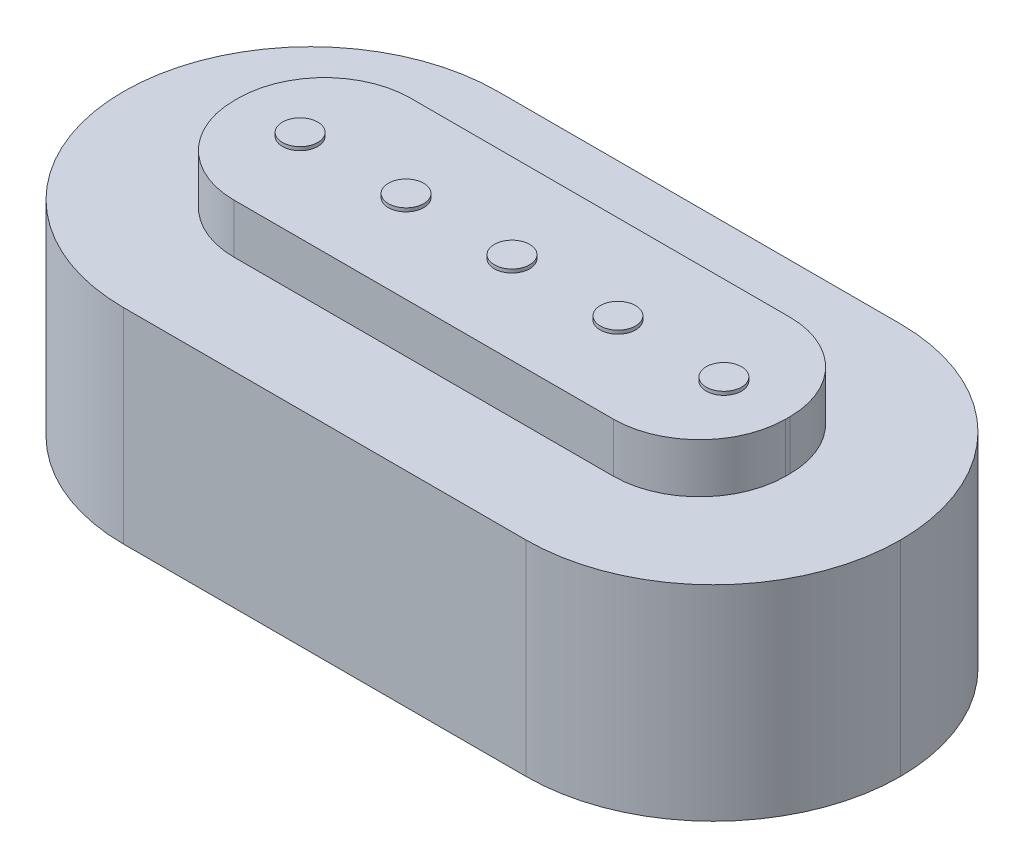
ISO-10303-21;
HEADER;
FILE_DESCRIPTION(('STEP AP214'),'2;1');
FILE_NAME('part.step','',(''),(''),'','','');
FILE_SCHEMA(('AUTOMOTIVE_DESIGN { 1 0 10303 214 1 1 1 1 }'));
ENDSEC;
DATA;
#1=APPLICATION_CONTEXT('core data for automotive mechanical design processes');
#2=APPLICATION_PROTOCOL_DEFINITION('international standard','automotive_design',2000,#1);
#3=PRODUCT_CONTEXT('',#1,'mechanical');
#4=PRODUCT('Part','Part','',(#3));
#5=PRODUCT_RELATED_PRODUCT_CATEGORY('part','',(#4));
#6=PRODUCT_DEFINITION_FORMATION('','',#4);
#7=PRODUCT_DEFINITION_CONTEXT('part definition',#1,'design');
#8=PRODUCT_DEFINITION('design','',#6,#7);
#9=PRODUCT_DEFINITION_SHAPE('','',#8);
#10=(LENGTH_UNIT() NAMED_UNIT(*) SI_UNIT(.MILLI.,.METRE.));
#11=(NAMED_UNIT(*) PLANE_ANGLE_UNIT() SI_UNIT($,.RADIAN.));
#12=(NAMED_UNIT(*) SI_UNIT($,.STERADIAN.) SOLID_ANGLE_UNIT());
#13=UNCERTAINTY_MEASURE_WITH_UNIT(LENGTH_MEASURE(1.E-05),#10,'distance_accuracy_value','');
#14=(GEOMETRIC_REPRESENTATION_CONTEXT(3) GLOBAL_UNCERTAINTY_ASSIGNED_CONTEXT((#13)) GLOBAL_UNIT_ASSIGNED_CONTEXT((#10,
#11,#12)) REPRESENTATION_CONTEXT('',''));
#15=CARTESIAN_POINT('',(0.,0.,0.));
#16=DIRECTION('',(0.,0.,1.));
#17=DIRECTION('',(1.,0.,0.));
#18=AXIS2_PLACEMENT_3D('',#15,#16,#17);
#19=CARTESIAN_POINT('',(-3.90322580645161,2.9,3.78036465638149));
#20=DIRECTION('',(0.,0.,-1.));
#21=DIRECTION('',(-1.,0.,0.));
#22=AXIS2_PLACEMENT_3D('',#19,#20,#21);
#23=PLANE('',#22);
#24=DIRECTION('',(1.,0.,0.));
#25=VECTOR('',#24,1.);
#26=CARTESIAN_POINT('',(-3.90322580645161,2.9,3.78036465638149));
#27=LINE('',#26,#25);
#28=CARTESIAN_POINT('',(-1.25322580645161,2.9,3.78036465638149));
#29=VERTEX_POINT('',#28);
#30=CARTESIAN_POINT('',(4.44677419354839,2.9,3.78036465638149));
#31=VERTEX_POINT('',#30);
#32=EDGE_CURVE('E301',#29,#31,#27,.T.);
#33=ORIENTED_EDGE('',*,*,#32,.F.);
#34=DIRECTION('',(0.,-1.,0.));
#35=VECTOR('',#34,1.);
#36=CARTESIAN_POINT('',(-1.25322580645161,2.9,3.78036465638149));
#37=LINE('',#36,#35);
#38=CARTESIAN_POINT('',(-1.25322580645161,0.,3.78036465638149));
#39=VERTEX_POINT('',#38);
#40=EDGE_CURVE('E196',#29,#39,#37,.T.);
#41=ORIENTED_EDGE('',*,*,#40,.T.);
#42=DIRECTION('',(1.,0.,0.));
#43=VECTOR('',#42,1.);
#44=CARTESIAN_POINT('',(-3.90322580645161,0.,3.78036465638149));
#45=LINE('',#44,#43);
#46=CARTESIAN_POINT('',(4.44677419354839,0.,3.78036465638149));
#47=VERTEX_POINT('',#46);
#48=EDGE_CURVE('E152',#39,#47,#45,.T.);
#49=ORIENTED_EDGE('',*,*,#48,.T.);
#50=DIRECTION('',(0.,-1.,0.));
#51=VECTOR('',#50,1.);
#52=CARTESIAN_POINT('',(4.44677419354839,2.9,3.78036465638149));
#53=LINE('',#52,#51);
#54=EDGE_CURVE('E192',#47,#31,#53,.F.);
#55=ORIENTED_EDGE('',*,*,#54,.T.);
#56=EDGE_LOOP('',(#33,#41,#49,#55));
#57=FACE_BOUND('',#56,.T.);
#58=ADVANCED_FACE('F43',(#57),#23,.F.);
#59=CARTESIAN_POINT('',(-3.90322580645161,2.9,-1.51963534361851));
#60=DIRECTION('',(0.,0.,1.));
#61=DIRECTION('',(1.,0.,0.));
#62=AXIS2_PLACEMENT_3D('',#59,#60,#61);
#63=PLANE('',#62);
#64=DIRECTION('',(-1.,0.,0.));
#65=VECTOR('',#64,1.);
#66=CARTESIAN_POINT('',(-3.90322580645161,0.,-1.51963534361851));
#67=LINE('',#66,#65);
#68=CARTESIAN_POINT('',(4.44677419354839,0.,-1.51963534361851));
#69=VERTEX_POINT('',#68);
#70=CARTESIAN_POINT('',(-1.25322580645161,0.,-1.51963534361851));
#71=VERTEX_POINT('',#70);
#72=EDGE_CURVE('E306',#69,#71,#67,.T.);
#73=ORIENTED_EDGE('',*,*,#72,.T.);
#74=DIRECTION('',(0.,-1.,0.));
#75=VECTOR('',#74,1.);
#76=CARTESIAN_POINT('',(-1.25322580645161,2.9,-1.51963534361851));
#77=LINE('',#76,#75);
#78=CARTESIAN_POINT('',(-1.25322580645161,2.9,-1.51963534361851));
#79=VERTEX_POINT('',#78);
#80=EDGE_CURVE('E171',#71,#79,#77,.F.);
#81=ORIENTED_EDGE('',*,*,#80,.T.);
#82=DIRECTION('',(-1.,0.,0.));
#83=VECTOR('',#82,1.);
#84=CARTESIAN_POINT('',(-3.90322580645161,2.9,-1.51963534361851));
#85=LINE('',#84,#83);
#86=CARTESIAN_POINT('',(4.44677419354839,2.9,-1.51963534361851));
#87=VERTEX_POINT('',#86);
#88=EDGE_CURVE('E305',#87,#79,#85,.T.);
#89=ORIENTED_EDGE('',*,*,#88,.F.);
#90=DIRECTION('',(0.,-1.,0.));
#91=VECTOR('',#90,1.);
#92=CARTESIAN_POINT('',(4.44677419354839,2.9,-1.51963534361851));
#93=LINE('',#92,#91);
#94=EDGE_CURVE('E173',#87,#69,#93,.T.);
#95=ORIENTED_EDGE('',*,*,#94,.T.);
#96=EDGE_LOOP('',(#73,#81,#89,#95));
#97=FACE_BOUND('',#96,.T.);
#98=ADVANCED_FACE('F391',(#97),#63,.F.);
#99=CARTESIAN_POINT('',(0.,2.9,0.));
#100=DIRECTION('',(0.,1.,0.));
#101=DIRECTION('',(0.,0.,1.));
#102=AXIS2_PLACEMENT_3D('',#99,#100,#101);
#103=PLANE('',#102);
#104=DIRECTION('',(0.,0.,1.));
#105=VECTOR('',#104,1.);
#106=CARTESIAN_POINT('',(-2.30822580645161,2.9,-0.119635343618514));
#107=LINE('',#106,#105);
#108=CARTESIAN_POINT('',(-2.30822580645161,2.9,1.10036465638149));
#109=VERTEX_POINT('',#108);
#110=CARTESIAN_POINT('',(-2.30822580645161,2.9,1.16036465638149));
#111=VERTEX_POINT('',#110);
#112=EDGE_CURVE('E253',#109,#111,#107,.T.);
#113=ORIENTED_EDGE('',*,*,#112,.F.);
#114=CARTESIAN_POINT('',(-1.08822580645161,2.9,1.10036465638149));
#115=DIRECTION('',(0.,1.,0.));
#116=DIRECTION('',(0.,0.,1.));
#117=AXIS2_PLACEMENT_3D('',#114,#115,#116);
#118=CIRCLE('',#117,1.22);
#119=CARTESIAN_POINT('',(-1.08822580645161,2.9,-0.119635343618514));
#120=VERTEX_POINT('',#119);
#121=EDGE_CURVE('E244',#109,#120,#118,.F.);
#122=ORIENTED_EDGE('',*,*,#121,.T.);
#123=DIRECTION('',(-1.,0.,0.));
#124=VECTOR('',#123,1.);
#125=CARTESIAN_POINT('',(-2.30822580645161,2.9,-0.119635343618514));
#126=LINE('',#125,#124);
#127=CARTESIAN_POINT('',(4.28177419354839,2.9,-0.119635343618513));
#128=VERTEX_POINT('',#127);
#129=EDGE_CURVE('E251',#128,#120,#126,.T.);
#130=ORIENTED_EDGE('',*,*,#129,.F.);
#131=CARTESIAN_POINT('',(4.28177419354839,2.9,1.10036465638149));
#132=DIRECTION('',(0.,1.,0.));
#133=DIRECTION('',(0.,0.,1.));
#134=AXIS2_PLACEMENT_3D('',#131,#132,#133);
#135=CIRCLE('',#134,1.22);
#136=CARTESIAN_POINT('',(5.50177419354839,2.9,1.10036465638149));
#137=VERTEX_POINT('',#136);
#138=EDGE_CURVE('E52',#128,#137,#135,.F.);
#139=ORIENTED_EDGE('',*,*,#138,.T.);
#140=DIRECTION('',(0.,0.,-1.));
#141=VECTOR('',#140,1.);
#142=CARTESIAN_POINT('',(5.50177419354839,2.9,-0.119635343618513));
#143=LINE('',#142,#141);
#144=CARTESIAN_POINT('',(5.50177419354839,2.9,1.16036465638149));
#145=VERTEX_POINT('',#144);
#146=EDGE_CURVE('E264',#145,#137,#143,.T.);
#147=ORIENTED_EDGE('',*,*,#146,.F.);
#148=CARTESIAN_POINT('',(4.28177419354839,2.9,1.16036465638149));
#149=DIRECTION('',(0.,1.,0.));
#150=DIRECTION('',(0.,0.,1.));
#151=AXIS2_PLACEMENT_3D('',#148,#149,#150);
#152=CIRCLE('',#151,1.22);
#153=CARTESIAN_POINT('',(4.28177419354839,2.9,2.38036465638149));
#154=VERTEX_POINT('',#153);
#155=EDGE_CURVE('E12',#145,#154,#152,.F.);
#156=ORIENTED_EDGE('',*,*,#155,.T.);
#157=DIRECTION('',(1.,0.,0.));
#158=VECTOR('',#157,1.);
#159=CARTESIAN_POINT('',(-2.30822580645161,2.9,2.38036465638149));
#160=LINE('',#159,#158);
#161=CARTESIAN_POINT('',(-1.08822580645161,2.9,2.38036465638149));
#162=VERTEX_POINT('',#161);
#163=EDGE_CURVE('E295',#162,#154,#160,.T.);
#164=ORIENTED_EDGE('',*,*,#163,.F.);
#165=CARTESIAN_POINT('',(-1.08822580645161,2.9,1.16036465638149));
#166=DIRECTION('',(0.,1.,0.));
#167=DIRECTION('',(0.,0.,1.));
#168=AXIS2_PLACEMENT_3D('',#165,#166,#167);
#169=CIRCLE('',#168,1.22);
#170=EDGE_CURVE('E241',#162,#111,#169,.F.);
#171=ORIENTED_EDGE('',*,*,#170,.T.);
#172=EDGE_LOOP('',(#113,#122,#130,#139,#147,#156,#164,#171));
#173=FACE_BOUND('',#172,.T.);
#174=ORIENTED_EDGE('',*,*,#88,.T.);
#175=CARTESIAN_POINT('',(-1.25322580645161,2.9,1.13036465638149));
#176=DIRECTION('',(0.,1.,0.));
#177=DIRECTION('',(0.,0.,1.));
#178=AXIS2_PLACEMENT_3D('',#175,#176,#177);
#179=CIRCLE('',#178,2.65);
#180=CARTESIAN_POINT('',(-3.90322580645161,2.9,1.13036465638149));
#181=VERTEX_POINT('',#180);
#182=EDGE_CURVE('E189',#79,#181,#179,.T.);
#183=ORIENTED_EDGE('',*,*,#182,.T.);
#184=CARTESIAN_POINT('',(-1.25322580645161,2.9,1.13036465638149));
#185=DIRECTION('',(0.,1.,0.));
#186=DIRECTION('',(0.,0.,1.));
#187=AXIS2_PLACEMENT_3D('',#184,#185,#186);
#188=CIRCLE('',#187,2.65);
#189=EDGE_CURVE('E162',#181,#29,#188,.T.);
#190=ORIENTED_EDGE('',*,*,#189,.T.);
#191=ORIENTED_EDGE('',*,*,#32,.T.);
#192=CARTESIAN_POINT('',(4.44677419354839,2.9,1.13036465638149));
#193=DIRECTION('',(0.,1.,0.));
#194=DIRECTION('',(0.,0.,1.));
#195=AXIS2_PLACEMENT_3D('',#192,#193,#194);
#196=CIRCLE('',#195,2.65);
#197=CARTESIAN_POINT('',(7.09677419354839,2.9,1.13036465638149));
#198=VERTEX_POINT('',#197);
#199=EDGE_CURVE('E184',#31,#198,#196,.T.);
#200=ORIENTED_EDGE('',*,*,#199,.T.);
#201=CARTESIAN_POINT('',(4.44677419354839,2.9,1.13036465638149));
#202=DIRECTION('',(0.,1.,0.));
#203=DIRECTION('',(0.,0.,1.));
#204=AXIS2_PLACEMENT_3D('',#201,#202,#203);
#205=CIRCLE('',#204,2.65);
#206=EDGE_CURVE('E181',#198,#87,#205,.T.);
#207=ORIENTED_EDGE('',*,*,#206,.T.);
#208=EDGE_LOOP('',(#174,#183,#190,#191,#200,#207));
#209=FACE_BOUND('',#208,.T.);
#210=ADVANCED_FACE('F249',(#173,#209),#103,.T.);
#211=CARTESIAN_POINT('',(0.,0.,0.));
#212=DIRECTION('',(0.,1.,0.));
#213=DIRECTION('',(0.,0.,1.));
#214=AXIS2_PLACEMENT_3D('',#211,#212,#213);
#215=PLANE('',#214);
#216=CARTESIAN_POINT('',(-1.40322580645161,0.,1.13036465638149));
#217=DIRECTION('',(0.,1.,0.));
#218=DIRECTION('',(0.,0.,1.));
#219=AXIS2_PLACEMENT_3D('',#216,#217,#218);
#220=CIRCLE('',#219,0.25);
#221=CARTESIAN_POINT('',(-1.40322580645161,0.,1.38036465638149));
#222=VERTEX_POINT('',#221);
#223=EDGE_CURVE('E542',#222,#222,#220,.T.);
#224=ORIENTED_EDGE('',*,*,#223,.T.);
#225=EDGE_LOOP('',(#224));
#226=FACE_BOUND('',#225,.T.);
#227=CARTESIAN_POINT('',(0.0967741935483884,0.,1.13036465638149));
#228=DIRECTION('',(0.,1.,0.));
#229=DIRECTION('',(0.,0.,1.));
#230=AXIS2_PLACEMENT_3D('',#227,#228,#229);
#231=CIRCLE('',#230,0.25);
#232=CARTESIAN_POINT('',(0.0967741935483884,0.,1.38036465638149));
#233=VERTEX_POINT('',#232);
#234=EDGE_CURVE('E550',#233,#233,#231,.T.);
#235=ORIENTED_EDGE('',*,*,#234,.T.);
#236=EDGE_LOOP('',(#235));
#237=FACE_BOUND('',#236,.T.);
#238=CARTESIAN_POINT('',(4.59677419354839,0.,1.13036465638149));
#239=DIRECTION('',(0.,1.,0.));
#240=DIRECTION('',(0.,0.,1.));
#241=AXIS2_PLACEMENT_3D('',#238,#239,#240);
#242=CIRCLE('',#241,0.25);
#243=CARTESIAN_POINT('',(4.59677419354839,0.,1.38036465638149));
#244=VERTEX_POINT('',#243);
#245=EDGE_CURVE('E562',#244,#244,#242,.T.);
#246=ORIENTED_EDGE('',*,*,#245,.T.);
#247=EDGE_LOOP('',(#246));
#248=FACE_BOUND('',#247,.T.);
#249=CARTESIAN_POINT('',(3.09677419354839,0.,1.13036465638149));
#250=DIRECTION('',(0.,1.,0.));
#251=DIRECTION('',(0.,0.,1.));
#252=AXIS2_PLACEMENT_3D('',#249,#250,#251);
#253=CIRCLE('',#252,0.25);
#254=CARTESIAN_POINT('',(3.09677419354839,0.,1.38036465638149));
#255=VERTEX_POINT('',#254);
#256=EDGE_CURVE('E570',#255,#255,#253,.T.);
#257=ORIENTED_EDGE('',*,*,#256,.T.);
#258=EDGE_LOOP('',(#257));
#259=FACE_BOUND('',#258,.T.);
#260=CARTESIAN_POINT('',(1.59677419354839,0.,1.13036465638149));
#261=DIRECTION('',(0.,1.,0.));
#262=DIRECTION('',(0.,0.,1.));
#263=AXIS2_PLACEMENT_3D('',#260,#261,#262);
#264=CIRCLE('',#263,0.25);
#265=CARTESIAN_POINT('',(1.59677419354839,0.,1.38036465638149));
#266=VERTEX_POINT('',#265);
#267=EDGE_CURVE('E285',#266,#266,#264,.T.);
#268=ORIENTED_EDGE('',*,*,#267,.T.);
#269=EDGE_LOOP('',(#268));
#270=FACE_BOUND('',#269,.T.);
#271=CARTESIAN_POINT('',(-1.25322580645161,0.,1.13036465638149));
#272=DIRECTION('',(0.,1.,0.));
#273=DIRECTION('',(0.,0.,1.));
#274=AXIS2_PLACEMENT_3D('',#271,#272,#273);
#275=CIRCLE('',#274,2.65);
#276=CARTESIAN_POINT('',(-3.90322580645161,0.,1.13036465638149));
#277=VERTEX_POINT('',#276);
#278=EDGE_CURVE('E144',#39,#277,#275,.F.);
#279=ORIENTED_EDGE('',*,*,#278,.T.);
#280=CARTESIAN_POINT('',(-1.25322580645161,0.,1.13036465638149));
#281=DIRECTION('',(0.,1.,0.));
#282=DIRECTION('',(0.,0.,1.));
#283=AXIS2_PLACEMENT_3D('',#280,#281,#282);
#284=CIRCLE('',#283,2.65);
#285=EDGE_CURVE('E149',#277,#71,#284,.F.);
#286=ORIENTED_EDGE('',*,*,#285,.T.);
#287=ORIENTED_EDGE('',*,*,#72,.F.);
#288=CARTESIAN_POINT('',(4.44677419354839,0.,1.13036465638149));
#289=DIRECTION('',(0.,1.,0.));
#290=DIRECTION('',(0.,0.,1.));
#291=AXIS2_PLACEMENT_3D('',#288,#289,#290);
#292=CIRCLE('',#291,2.65);
#293=CARTESIAN_POINT('',(7.09677419354839,0.,1.13036465638149));
#294=VERTEX_POINT('',#293);
#295=EDGE_CURVE('E374',#69,#294,#292,.F.);
#296=ORIENTED_EDGE('',*,*,#295,.T.);
#297=CARTESIAN_POINT('',(4.44677419354839,0.,1.13036465638149));
#298=DIRECTION('',(0.,1.,0.));
#299=DIRECTION('',(0.,0.,1.));
#300=AXIS2_PLACEMENT_3D('',#297,#298,#299);
#301=CIRCLE('',#300,2.65);
#302=EDGE_CURVE('E156',#294,#47,#301,.F.);
#303=ORIENTED_EDGE('',*,*,#302,.T.);
#304=ORIENTED_EDGE('',*,*,#48,.F.);
#305=EDGE_LOOP('',(#279,#286,#287,#296,#303,#304));
#306=FACE_BOUND('',#305,.T.);
#307=ADVANCED_FACE('F146',(#226,#237,#248,#259,#270,#306),#215,.F.);
#308=CARTESIAN_POINT('',(-2.30822580645161,3.6,-0.119635343618514));
#309=DIRECTION('',(1.,0.,0.));
#310=DIRECTION('',(0.,0.,-1.));
#311=AXIS2_PLACEMENT_3D('',#308,#309,#310);
#312=PLANE('',#311);
#313=ORIENTED_EDGE('',*,*,#112,.T.);
#314=DIRECTION('',(0.,-1.,0.));
#315=VECTOR('',#314,1.);
#316=CARTESIAN_POINT('',(-2.30822580645161,3.6,1.16036465638149));
#317=LINE('',#316,#315);
#318=CARTESIAN_POINT('',(-2.30822580645161,3.6,1.16036465638149));
#319=VERTEX_POINT('',#318);
#320=EDGE_CURVE('E213',#111,#319,#317,.F.);
#321=ORIENTED_EDGE('',*,*,#320,.T.);
#322=DIRECTION('',(0.,0.,1.));
#323=VECTOR('',#322,1.);
#324=CARTESIAN_POINT('',(-2.30822580645161,3.6,-0.119635343618514));
#325=LINE('',#324,#323);
#326=CARTESIAN_POINT('',(-2.30822580645161,3.6,1.10036465638149));
#327=VERTEX_POINT('',#326);
#328=EDGE_CURVE('E263',#327,#319,#325,.T.);
#329=ORIENTED_EDGE('',*,*,#328,.F.);
#330=DIRECTION('',(0.,-1.,0.));
#331=VECTOR('',#330,1.);
#332=CARTESIAN_POINT('',(-2.30822580645161,3.6,1.10036465638149));
#333=LINE('',#332,#331);
#334=EDGE_CURVE('E209',#327,#109,#333,.T.);
#335=ORIENTED_EDGE('',*,*,#334,.T.);
#336=EDGE_LOOP('',(#313,#321,#329,#335));
#337=FACE_BOUND('',#336,.T.);
#338=ADVANCED_FACE('F275',(#337),#312,.F.);
#339=CARTESIAN_POINT('',(-2.30822580645161,3.6,2.38036465638149));
#340=DIRECTION('',(0.,0.,-1.));
#341=DIRECTION('',(-1.,0.,0.));
#342=AXIS2_PLACEMENT_3D('',#339,#340,#341);
#343=PLANE('',#342);
#344=DIRECTION('',(1.,0.,0.));
#345=VECTOR('',#344,1.);
#346=CARTESIAN_POINT('',(-2.30822580645161,3.6,2.38036465638149));
#347=LINE('',#346,#345);
#348=CARTESIAN_POINT('',(-1.08822580645161,3.6,2.38036465638149));
#349=VERTEX_POINT('',#348);
#350=CARTESIAN_POINT('',(4.28177419354839,3.6,2.38036465638149));
#351=VERTEX_POINT('',#350);
#352=EDGE_CURVE('E278',#349,#351,#347,.T.);
#353=ORIENTED_EDGE('',*,*,#352,.F.);
#354=DIRECTION('',(0.,-1.,0.));
#355=VECTOR('',#354,1.);
#356=CARTESIAN_POINT('',(-1.08822580645161,3.6,2.38036465638149));
#357=LINE('',#356,#355);
#358=EDGE_CURVE('E205',#349,#162,#357,.T.);
#359=ORIENTED_EDGE('',*,*,#358,.T.);
#360=ORIENTED_EDGE('',*,*,#163,.T.);
#361=DIRECTION('',(0.,-1.,0.));
#362=VECTOR('',#361,1.);
#363=CARTESIAN_POINT('',(4.28177419354839,3.6,2.38036465638149));
#364=LINE('',#363,#362);
#365=EDGE_CURVE('E198',#154,#351,#364,.F.);
#366=ORIENTED_EDGE('',*,*,#365,.T.);
#367=EDGE_LOOP('',(#353,#359,#360,#366));
#368=FACE_BOUND('',#367,.T.);
#369=ADVANCED_FACE('F450',(#368),#343,.F.);
#370=CARTESIAN_POINT('',(5.50177419354839,3.6,-0.119635343618513));
#371=DIRECTION('',(-1.,0.,0.));
#372=DIRECTION('',(0.,0.,1.));
#373=AXIS2_PLACEMENT_3D('',#370,#371,#372);
#374=PLANE('',#373);
#375=ORIENTED_EDGE('',*,*,#146,.T.);
#376=DIRECTION('',(0.,-1.,0.));
#377=VECTOR('',#376,1.);
#378=CARTESIAN_POINT('',(5.50177419354839,3.6,1.10036465638149));
#379=LINE('',#378,#377);
#380=CARTESIAN_POINT('',(5.50177419354839,3.6,1.10036465638149));
#381=VERTEX_POINT('',#380);
#382=EDGE_CURVE('E238',#137,#381,#379,.F.);
#383=ORIENTED_EDGE('',*,*,#382,.T.);
#384=DIRECTION('',(0.,0.,-1.));
#385=VECTOR('',#384,1.);
#386=CARTESIAN_POINT('',(5.50177419354839,3.6,-0.119635343618513));
#387=LINE('',#386,#385);
#388=CARTESIAN_POINT('',(5.50177419354839,3.6,1.16036465638149));
#389=VERTEX_POINT('',#388);
#390=EDGE_CURVE('E282',#389,#381,#387,.T.);
#391=ORIENTED_EDGE('',*,*,#390,.F.);
#392=DIRECTION('',(0.,-1.,0.));
#393=VECTOR('',#392,1.);
#394=CARTESIAN_POINT('',(5.50177419354839,3.6,1.16036465638149));
#395=LINE('',#394,#393);
#396=EDGE_CURVE('E235',#389,#145,#395,.T.);
#397=ORIENTED_EDGE('',*,*,#396,.T.);
#398=EDGE_LOOP('',(#375,#383,#391,#397));
#399=FACE_BOUND('',#398,.T.);
#400=ADVANCED_FACE('F447',(#399),#374,.F.);
#401=CARTESIAN_POINT('',(-2.30822580645161,3.6,-0.119635343618514));
#402=DIRECTION('',(0.,0.,1.));
#403=DIRECTION('',(1.,0.,0.));
#404=AXIS2_PLACEMENT_3D('',#401,#402,#403);
#405=PLANE('',#404);
#406=ORIENTED_EDGE('',*,*,#129,.T.);
#407=DIRECTION('',(0.,-1.,0.));
#408=VECTOR('',#407,1.);
#409=CARTESIAN_POINT('',(-1.08822580645161,3.6,-0.119635343618514));
#410=LINE('',#409,#408);
#411=CARTESIAN_POINT('',(-1.08822580645161,3.6,-0.119635343618514));
#412=VERTEX_POINT('',#411);
#413=EDGE_CURVE('E232',#120,#412,#410,.F.);
#414=ORIENTED_EDGE('',*,*,#413,.T.);
#415=DIRECTION('',(-1.,0.,0.));
#416=VECTOR('',#415,1.);
#417=CARTESIAN_POINT('',(-2.30822580645161,3.6,-0.119635343618514));
#418=LINE('',#417,#416);
#419=CARTESIAN_POINT('',(4.28177419354839,3.6,-0.119635343618513));
#420=VERTEX_POINT('',#419);
#421=EDGE_CURVE('E273',#420,#412,#418,.T.);
#422=ORIENTED_EDGE('',*,*,#421,.F.);
#423=DIRECTION('',(0.,-1.,0.));
#424=VECTOR('',#423,1.);
#425=CARTESIAN_POINT('',(4.28177419354839,3.6,-0.119635343618513));
#426=LINE('',#425,#424);
#427=EDGE_CURVE('E228',#420,#128,#426,.T.);
#428=ORIENTED_EDGE('',*,*,#427,.T.);
#429=EDGE_LOOP('',(#406,#414,#422,#428));
#430=FACE_BOUND('',#429,.T.);
#431=ADVANCED_FACE('F258',(#430),#405,.F.);
#432=CARTESIAN_POINT('',(0.,3.6,0.));
#433=DIRECTION('',(0.,1.,0.));
#434=DIRECTION('',(0.,0.,1.));
#435=AXIS2_PLACEMENT_3D('',#432,#433,#434);
#436=PLANE('',#435);
#437=CARTESIAN_POINT('',(-1.40322580645161,3.6,1.13036465638149));
#438=DIRECTION('',(0.,1.,0.));
#439=DIRECTION('',(0.,0.,1.));
#440=AXIS2_PLACEMENT_3D('',#437,#438,#439);
#441=CIRCLE('',#440,0.25);
#442=CARTESIAN_POINT('',(-1.40322580645161,3.6,1.38036465638149));
#443=VERTEX_POINT('',#442);
#444=EDGE_CURVE('E330',#443,#443,#441,.T.);
#445=ORIENTED_EDGE('',*,*,#444,.F.);
#446=EDGE_LOOP('',(#445));
#447=FACE_BOUND('',#446,.T.);
#448=CARTESIAN_POINT('',(0.0967741935483884,3.6,1.13036465638149));
#449=DIRECTION('',(0.,1.,0.));
#450=DIRECTION('',(0.,0.,1.));
#451=AXIS2_PLACEMENT_3D('',#448,#449,#450);
#452=CIRCLE('',#451,0.25);
#453=CARTESIAN_POINT('',(0.0967741935483884,3.6,1.38036465638149));
#454=VERTEX_POINT('',#453);
#455=EDGE_CURVE('E326',#454,#454,#452,.T.);
#456=ORIENTED_EDGE('',*,*,#455,.F.);
#457=EDGE_LOOP('',(#456));
#458=FACE_BOUND('',#457,.T.);
#459=CARTESIAN_POINT('',(4.59677419354839,3.6,1.13036465638149));
#460=DIRECTION('',(0.,1.,0.));
#461=DIRECTION('',(0.,0.,1.));
#462=AXIS2_PLACEMENT_3D('',#459,#460,#461);
#463=CIRCLE('',#462,0.25);
#464=CARTESIAN_POINT('',(4.59677419354839,3.6,1.38036465638149));
#465=VERTEX_POINT('',#464);
#466=EDGE_CURVE('E322',#465,#465,#463,.T.);
#467=ORIENTED_EDGE('',*,*,#466,.F.);
#468=EDGE_LOOP('',(#467));
#469=FACE_BOUND('',#468,.T.);
#470=CARTESIAN_POINT('',(3.09677419354839,3.6,1.13036465638149));
#471=DIRECTION('',(0.,1.,0.));
#472=DIRECTION('',(0.,0.,1.));
#473=AXIS2_PLACEMENT_3D('',#470,#471,#472);
#474=CIRCLE('',#473,0.25);
#475=CARTESIAN_POINT('',(3.09677419354839,3.6,1.38036465638149));
#476=VERTEX_POINT('',#475);
#477=EDGE_CURVE('E318',#476,#476,#474,.T.);
#478=ORIENTED_EDGE('',*,*,#477,.F.);
#479=EDGE_LOOP('',(#478));
#480=FACE_BOUND('',#479,.T.);
#481=CARTESIAN_POINT('',(1.59677419354839,3.6,1.13036465638149));
#482=DIRECTION('',(0.,1.,0.));
#483=DIRECTION('',(0.,0.,1.));
#484=AXIS2_PLACEMENT_3D('',#481,#482,#483);
#485=CIRCLE('',#484,0.25);
#486=CARTESIAN_POINT('',(1.59677419354839,3.6,1.38036465638149));
#487=VERTEX_POINT('',#486);
#488=EDGE_CURVE('E310',#487,#487,#485,.T.);
#489=ORIENTED_EDGE('',*,*,#488,.F.);
#490=EDGE_LOOP('',(#489));
#491=FACE_BOUND('',#490,.T.);
#492=ORIENTED_EDGE('',*,*,#328,.T.);
#493=CARTESIAN_POINT('',(-1.08822580645161,3.6,1.16036465638149));
#494=DIRECTION('',(0.,1.,0.));
#495=DIRECTION('',(0.,0.,1.));
#496=AXIS2_PLACEMENT_3D('',#493,#494,#495);
#497=CIRCLE('',#496,1.22);
#498=EDGE_CURVE('E225',#319,#349,#497,.T.);
#499=ORIENTED_EDGE('',*,*,#498,.T.);
#500=ORIENTED_EDGE('',*,*,#352,.T.);
#501=CARTESIAN_POINT('',(4.28177419354839,3.6,1.16036465638149));
#502=DIRECTION('',(0.,1.,0.));
#503=DIRECTION('',(0.,0.,1.));
#504=AXIS2_PLACEMENT_3D('',#501,#502,#503);
#505=CIRCLE('',#504,1.22);
#506=EDGE_CURVE('E216',#351,#389,#505,.T.);
#507=ORIENTED_EDGE('',*,*,#506,.T.);
#508=ORIENTED_EDGE('',*,*,#390,.T.);
#509=CARTESIAN_POINT('',(4.28177419354839,3.6,1.10036465638149));
#510=DIRECTION('',(0.,1.,0.));
#511=DIRECTION('',(0.,0.,1.));
#512=AXIS2_PLACEMENT_3D('',#509,#510,#511);
#513=CIRCLE('',#512,1.22);
#514=EDGE_CURVE('E219',#381,#420,#513,.T.);
#515=ORIENTED_EDGE('',*,*,#514,.T.);
#516=ORIENTED_EDGE('',*,*,#421,.T.);
#517=CARTESIAN_POINT('',(-1.08822580645161,3.6,1.10036465638149));
#518=DIRECTION('',(0.,1.,0.));
#519=DIRECTION('',(0.,0.,1.));
#520=AXIS2_PLACEMENT_3D('',#517,#518,#519);
#521=CIRCLE('',#520,1.22);
#522=EDGE_CURVE('E222',#412,#327,#521,.T.);
#523=ORIENTED_EDGE('',*,*,#522,.T.);
#524=EDGE_LOOP('',(#492,#499,#500,#507,#508,#515,#516,#523));
#525=FACE_BOUND('',#524,.T.);
#526=ADVANCED_FACE('F271',(#447,#458,#469,#480,#491,#525),#436,.T.);
#527=CARTESIAN_POINT('',(0.,3.65,0.));
#528=DIRECTION('',(0.,1.,0.));
#529=DIRECTION('',(0.,0.,1.));
#530=AXIS2_PLACEMENT_3D('',#527,#528,#529);
#531=PLANE('',#530);
#532=CARTESIAN_POINT('',(1.59677419354839,3.65,1.13036465638149));
#533=DIRECTION('',(0.,1.,0.));
#534=DIRECTION('',(0.,0.,1.));
#535=AXIS2_PLACEMENT_3D('',#532,#533,#534);
#536=CIRCLE('',#535,0.25);
#537=CARTESIAN_POINT('',(1.59677419354839,3.65,1.38036465638149));
#538=VERTEX_POINT('',#537);
#539=EDGE_CURVE('E573',#538,#538,#536,.F.);
#540=ORIENTED_EDGE('',*,*,#539,.F.);
#541=EDGE_LOOP('',(#540));
#542=FACE_BOUND('',#541,.T.);
#543=ADVANCED_FACE('F466',(#542),#531,.T.);
#544=CARTESIAN_POINT('',(1.59677419354839,4.40710678118655,1.13036465638149));
#545=DIRECTION('',(0.,-1.,0.));
#546=DIRECTION('',(0.,0.,-1.));
#547=AXIS2_PLACEMENT_3D('',#544,#545,#546);
#548=CYLINDRICAL_SURFACE('',#547,0.25);
#549=ORIENTED_EDGE('',*,*,#488,.T.);
#550=EDGE_LOOP('',(#549));
#551=FACE_BOUND('',#550,.T.);
#552=ORIENTED_EDGE('',*,*,#539,.T.);
#553=EDGE_LOOP('',(#552));
#554=FACE_BOUND('',#553,.T.);
#555=ADVANCED_FACE('F470',(#551,#554),#548,.T.);
#556=CARTESIAN_POINT('',(1.59677419354839,-1.52,1.13036465638149));
#557=DIRECTION('',(0.,-1.,0.));
#558=DIRECTION('',(0.,0.,-1.));
#559=AXIS2_PLACEMENT_3D('',#556,#557,#558);
#560=CIRCLE('',#559,0.25);
#561=CARTESIAN_POINT('',(1.59677419354839,-1.52,0.880364656381487));
#562=VERTEX_POINT('',#561);
#563=EDGE_CURVE('E362',#562,#562,#560,.F.);
#564=ORIENTED_EDGE('',*,*,#563,.T.);
#565=EDGE_LOOP('',(#564));
#566=FACE_BOUND('',#565,.T.);
#567=ORIENTED_EDGE('',*,*,#267,.F.);
#568=EDGE_LOOP('',(#567));
#569=FACE_BOUND('',#568,.T.);
#570=ADVANCED_FACE('F474',(#566,#569),#548,.T.);
#571=CARTESIAN_POINT('',(1.59677419354839,-1.6,1.13036465638149));
#572=DIRECTION('',(0.,-1.,0.));
#573=DIRECTION('',(0.,0.,-1.));
#574=AXIS2_PLACEMENT_3D('',#571,#572,#573);
#575=PLANE('',#574);
#576=CARTESIAN_POINT('',(1.59677419354839,-1.6,1.13036465638149));
#577=DIRECTION('',(0.,-1.,0.));
#578=DIRECTION('',(0.,0.,-1.));
#579=AXIS2_PLACEMENT_3D('',#576,#577,#578);
#580=CIRCLE('',#579,0.17);
#581=CARTESIAN_POINT('',(1.59677419354839,-1.6,0.960364656381487));
#582=VERTEX_POINT('',#581);
#583=EDGE_CURVE('E358',#582,#582,#580,.T.);
#584=ORIENTED_EDGE('',*,*,#583,.T.);
#585=EDGE_LOOP('',(#584));
#586=FACE_BOUND('',#585,.T.);
#587=ADVANCED_FACE('F476',(#586),#575,.T.);
#588=CARTESIAN_POINT('',(0.,3.65,0.));
#589=DIRECTION('',(0.,1.,0.));
#590=DIRECTION('',(0.,0.,1.));
#591=AXIS2_PLACEMENT_3D('',#588,#589,#590);
#592=PLANE('',#591);
#593=CARTESIAN_POINT('',(3.09677419354839,3.65,1.13036465638149));
#594=DIRECTION('',(0.,1.,0.));
#595=DIRECTION('',(0.,0.,1.));
#596=AXIS2_PLACEMENT_3D('',#593,#594,#595);
#597=CIRCLE('',#596,0.25);
#598=CARTESIAN_POINT('',(3.09677419354839,3.65,1.38036465638149));
#599=VERTEX_POINT('',#598);
#600=EDGE_CURVE('E566',#599,#599,#597,.F.);
#601=ORIENTED_EDGE('',*,*,#600,.F.);
#602=EDGE_LOOP('',(#601));
#603=FACE_BOUND('',#602,.T.);
#604=ADVANCED_FACE('F479',(#603),#592,.T.);
#605=CARTESIAN_POINT('',(3.09677419354839,4.40710678118655,1.13036465638149));
#606=DIRECTION('',(0.,-1.,0.));
#607=DIRECTION('',(0.,0.,-1.));
#608=AXIS2_PLACEMENT_3D('',#605,#606,#607);
#609=CYLINDRICAL_SURFACE('',#608,0.25);
#610=ORIENTED_EDGE('',*,*,#477,.T.);
#611=EDGE_LOOP('',(#610));
#612=FACE_BOUND('',#611,.T.);
#613=ORIENTED_EDGE('',*,*,#600,.T.);
#614=EDGE_LOOP('',(#613));
#615=FACE_BOUND('',#614,.T.);
#616=ADVANCED_FACE('F483',(#612,#615),#609,.T.);
#617=CARTESIAN_POINT('',(3.09677419354839,-1.52,1.13036465638149));
#618=DIRECTION('',(0.,-1.,0.));
#619=DIRECTION('',(0.,0.,-1.));
#620=AXIS2_PLACEMENT_3D('',#617,#618,#619);
#621=CIRCLE('',#620,0.25);
#622=CARTESIAN_POINT('',(3.09677419354839,-1.52,0.880364656381487));
#623=VERTEX_POINT('',#622);
#624=EDGE_CURVE('E370',#623,#623,#621,.F.);
#625=ORIENTED_EDGE('',*,*,#624,.T.);
#626=EDGE_LOOP('',(#625));
#627=FACE_BOUND('',#626,.T.);
#628=ORIENTED_EDGE('',*,*,#256,.F.);
#629=EDGE_LOOP('',(#628));
#630=FACE_BOUND('',#629,.T.);
#631=ADVANCED_FACE('F487',(#627,#630),#609,.T.);
#632=CARTESIAN_POINT('',(3.09677419354839,-1.6,1.13036465638149));
#633=DIRECTION('',(0.,-1.,0.));
#634=DIRECTION('',(0.,0.,-1.));
#635=AXIS2_PLACEMENT_3D('',#632,#633,#634);
#636=PLANE('',#635);
#637=CARTESIAN_POINT('',(3.09677419354839,-1.6,1.13036465638149));
#638=DIRECTION('',(0.,-1.,0.));
#639=DIRECTION('',(0.,0.,-1.));
#640=AXIS2_PLACEMENT_3D('',#637,#638,#639);
#641=CIRCLE('',#640,0.17);
#642=CARTESIAN_POINT('',(3.09677419354839,-1.6,0.960364656381487));
#643=VERTEX_POINT('',#642);
#644=EDGE_CURVE('E366',#643,#643,#641,.T.);
#645=ORIENTED_EDGE('',*,*,#644,.T.);
#646=EDGE_LOOP('',(#645));
#647=FACE_BOUND('',#646,.T.);
#648=ADVANCED_FACE('F489',(#647),#636,.T.);
#649=CARTESIAN_POINT('',(0.,3.65,0.));
#650=DIRECTION('',(0.,1.,0.));
#651=DIRECTION('',(0.,0.,1.));
#652=AXIS2_PLACEMENT_3D('',#649,#650,#651);
#653=PLANE('',#652);
#654=CARTESIAN_POINT('',(4.59677419354839,3.65,1.13036465638149));
#655=DIRECTION('',(0.,1.,0.));
#656=DIRECTION('',(0.,0.,1.));
#657=AXIS2_PLACEMENT_3D('',#654,#655,#656);
#658=CIRCLE('',#657,0.25);
#659=CARTESIAN_POINT('',(4.59677419354839,3.65,1.38036465638149));
#660=VERTEX_POINT('',#659);
#661=EDGE_CURVE('E558',#660,#660,#658,.F.);
#662=ORIENTED_EDGE('',*,*,#661,.F.);
#663=EDGE_LOOP('',(#662));
#664=FACE_BOUND('',#663,.T.);
#665=ADVANCED_FACE('F492',(#664),#653,.T.);
#666=CARTESIAN_POINT('',(4.59677419354839,4.40710678118655,1.13036465638149));
#667=DIRECTION('',(0.,-1.,0.));
#668=DIRECTION('',(0.,0.,-1.));
#669=AXIS2_PLACEMENT_3D('',#666,#667,#668);
#670=CYLINDRICAL_SURFACE('',#669,0.25);
#671=ORIENTED_EDGE('',*,*,#466,.T.);
#672=EDGE_LOOP('',(#671));
#673=FACE_BOUND('',#672,.T.);
#674=ORIENTED_EDGE('',*,*,#661,.T.);
#675=EDGE_LOOP('',(#674));
#676=FACE_BOUND('',#675,.T.);
#677=ADVANCED_FACE('F496',(#673,#676),#670,.T.);
#678=CARTESIAN_POINT('',(4.59677419354839,-1.52,1.13036465638149));
#679=DIRECTION('',(0.,-1.,0.));
#680=DIRECTION('',(0.,0.,-1.));
#681=AXIS2_PLACEMENT_3D('',#678,#679,#680);
#682=CIRCLE('',#681,0.25);
#683=CARTESIAN_POINT('',(4.59677419354839,-1.52,0.880364656381487));
#684=VERTEX_POINT('',#683);
#685=EDGE_CURVE('E338',#684,#684,#682,.F.);
#686=ORIENTED_EDGE('',*,*,#685,.T.);
#687=EDGE_LOOP('',(#686));
#688=FACE_BOUND('',#687,.T.);
#689=ORIENTED_EDGE('',*,*,#245,.F.);
#690=EDGE_LOOP('',(#689));
#691=FACE_BOUND('',#690,.T.);
#692=ADVANCED_FACE('F500',(#688,#691),#670,.T.);
#693=CARTESIAN_POINT('',(4.59677419354839,-1.6,1.13036465638149));
#694=DIRECTION('',(0.,-1.,0.));
#695=DIRECTION('',(0.,0.,-1.));
#696=AXIS2_PLACEMENT_3D('',#693,#694,#695);
#697=PLANE('',#696);
#698=CARTESIAN_POINT('',(4.59677419354839,-1.6,1.13036465638149));
#699=DIRECTION('',(0.,-1.,0.));
#700=DIRECTION('',(0.,0.,-1.));
#701=AXIS2_PLACEMENT_3D('',#698,#699,#700);
#702=CIRCLE('',#701,0.17);
#703=CARTESIAN_POINT('',(4.59677419354839,-1.6,0.960364656381487));
#704=VERTEX_POINT('',#703);
#705=EDGE_CURVE('E334',#704,#704,#702,.T.);
#706=ORIENTED_EDGE('',*,*,#705,.T.);
#707=EDGE_LOOP('',(#706));
#708=FACE_BOUND('',#707,.T.);
#709=ADVANCED_FACE('F502',(#708),#697,.T.);
#710=CARTESIAN_POINT('',(0.,3.65,0.));
#711=DIRECTION('',(0.,1.,0.));
#712=DIRECTION('',(0.,0.,1.));
#713=AXIS2_PLACEMENT_3D('',#710,#711,#712);
#714=PLANE('',#713);
#715=CARTESIAN_POINT('',(0.0967741935483884,3.65,1.13036465638149));
#716=DIRECTION('',(0.,1.,0.));
#717=DIRECTION('',(0.,0.,1.));
#718=AXIS2_PLACEMENT_3D('',#715,#716,#717);
#719=CIRCLE('',#718,0.25);
#720=CARTESIAN_POINT('',(0.0967741935483884,3.65,1.38036465638149));
#721=VERTEX_POINT('',#720);
#722=EDGE_CURVE('E545',#721,#721,#719,.F.);
#723=ORIENTED_EDGE('',*,*,#722,.F.);
#724=EDGE_LOOP('',(#723));
#725=FACE_BOUND('',#724,.T.);
#726=ADVANCED_FACE('F505',(#725),#714,.T.);
#727=CARTESIAN_POINT('',(0.0967741935483884,4.40710678118655,1.13036465638149));
#728=DIRECTION('',(0.,-1.,0.));
#729=DIRECTION('',(0.,0.,-1.));
#730=AXIS2_PLACEMENT_3D('',#727,#728,#729);
#731=CYLINDRICAL_SURFACE('',#730,0.25);
#732=ORIENTED_EDGE('',*,*,#455,.T.);
#733=EDGE_LOOP('',(#732));
#734=FACE_BOUND('',#733,.T.);
#735=ORIENTED_EDGE('',*,*,#722,.T.);
#736=EDGE_LOOP('',(#735));
#737=FACE_BOUND('',#736,.T.);
#738=ADVANCED_FACE('F509',(#734,#737),#731,.T.);
#739=CARTESIAN_POINT('',(0.0967741935483884,-1.52,1.13036465638149));
#740=DIRECTION('',(0.,-1.,0.));
#741=DIRECTION('',(0.,0.,-1.));
#742=AXIS2_PLACEMENT_3D('',#739,#740,#741);
#743=CIRCLE('',#742,0.25);
#744=CARTESIAN_POINT('',(0.0967741935483884,-1.52,0.880364656381487));
#745=VERTEX_POINT('',#744);
#746=EDGE_CURVE('E354',#745,#745,#743,.F.);
#747=ORIENTED_EDGE('',*,*,#746,.T.);
#748=EDGE_LOOP('',(#747));
#749=FACE_BOUND('',#748,.T.);
#750=ORIENTED_EDGE('',*,*,#234,.F.);
#751=EDGE_LOOP('',(#750));
#752=FACE_BOUND('',#751,.T.);
#753=ADVANCED_FACE('F513',(#749,#752),#731,.T.);
#754=CARTESIAN_POINT('',(0.0967741935483884,-1.6,1.13036465638149));
#755=DIRECTION('',(0.,-1.,0.));
#756=DIRECTION('',(0.,0.,-1.));
#757=AXIS2_PLACEMENT_3D('',#754,#755,#756);
#758=PLANE('',#757);
#759=CARTESIAN_POINT('',(0.0967741935483884,-1.6,1.13036465638149));
#760=DIRECTION('',(0.,-1.,0.));
#761=DIRECTION('',(0.,0.,-1.));
#762=AXIS2_PLACEMENT_3D('',#759,#760,#761);
#763=CIRCLE('',#762,0.17);
#764=CARTESIAN_POINT('',(0.0967741935483884,-1.6,0.960364656381487));
#765=VERTEX_POINT('',#764);
#766=EDGE_CURVE('E350',#765,#765,#763,.T.);
#767=ORIENTED_EDGE('',*,*,#766,.T.);
#768=EDGE_LOOP('',(#767));
#769=FACE_BOUND('',#768,.T.);
#770=ADVANCED_FACE('F515',(#769),#758,.T.);
#771=CARTESIAN_POINT('',(0.,3.65,0.));
#772=DIRECTION('',(0.,1.,0.));
#773=DIRECTION('',(0.,0.,1.));
#774=AXIS2_PLACEMENT_3D('',#771,#772,#773);
#775=PLANE('',#774);
#776=CARTESIAN_POINT('',(-1.40322580645161,3.65,1.13036465638149));
#777=DIRECTION('',(0.,1.,0.));
#778=DIRECTION('',(0.,0.,1.));
#779=AXIS2_PLACEMENT_3D('',#776,#777,#778);
#780=CIRCLE('',#779,0.25);
#781=CARTESIAN_POINT('',(-1.40322580645161,3.65,1.38036465638149));
#782=VERTEX_POINT('',#781);
#783=EDGE_CURVE('E165',#782,#782,#780,.F.);
#784=ORIENTED_EDGE('',*,*,#783,.F.);
#785=EDGE_LOOP('',(#784));
#786=FACE_BOUND('',#785,.T.);
#787=ADVANCED_FACE('F518',(#786),#775,.T.);
#788=CARTESIAN_POINT('',(-1.40322580645161,4.40710678118655,1.13036465638149));
#789=DIRECTION('',(0.,-1.,0.));
#790=DIRECTION('',(0.,0.,-1.));
#791=AXIS2_PLACEMENT_3D('',#788,#789,#790);
#792=CYLINDRICAL_SURFACE('',#791,0.25);
#793=ORIENTED_EDGE('',*,*,#444,.T.);
#794=EDGE_LOOP('',(#793));
#795=FACE_BOUND('',#794,.T.);
#796=ORIENTED_EDGE('',*,*,#783,.T.);
#797=EDGE_LOOP('',(#796));
#798=FACE_BOUND('',#797,.T.);
#799=ADVANCED_FACE('F522',(#795,#798),#792,.T.);
#800=CARTESIAN_POINT('',(-1.40322580645161,-1.52,1.13036465638149));
#801=DIRECTION('',(0.,-1.,0.));
#802=DIRECTION('',(0.,0.,-1.));
#803=AXIS2_PLACEMENT_3D('',#800,#801,#802);
#804=CIRCLE('',#803,0.25);
#805=CARTESIAN_POINT('',(-1.40322580645161,-1.52,0.880364656381487));
#806=VERTEX_POINT('',#805);
#807=EDGE_CURVE('E346',#806,#806,#804,.F.);
#808=ORIENTED_EDGE('',*,*,#807,.T.);
#809=EDGE_LOOP('',(#808));
#810=FACE_BOUND('',#809,.T.);
#811=ORIENTED_EDGE('',*,*,#223,.F.);
#812=EDGE_LOOP('',(#811));
#813=FACE_BOUND('',#812,.T.);
#814=ADVANCED_FACE('F526',(#810,#813),#792,.T.);
#815=CARTESIAN_POINT('',(-1.40322580645161,-1.6,1.13036465638149));
#816=DIRECTION('',(0.,-1.,0.));
#817=DIRECTION('',(0.,0.,-1.));
#818=AXIS2_PLACEMENT_3D('',#815,#816,#817);
#819=PLANE('',#818);
#820=CARTESIAN_POINT('',(-1.40322580645161,-1.6,1.13036465638149));
#821=DIRECTION('',(0.,-1.,0.));
#822=DIRECTION('',(0.,0.,-1.));
#823=AXIS2_PLACEMENT_3D('',#820,#821,#822);
#824=CIRCLE('',#823,0.17);
#825=CARTESIAN_POINT('',(-1.40322580645161,-1.6,0.960364656381487));
#826=VERTEX_POINT('',#825);
#827=EDGE_CURVE('E342',#826,#826,#824,.T.);
#828=ORIENTED_EDGE('',*,*,#827,.T.);
#829=EDGE_LOOP('',(#828));
#830=FACE_BOUND('',#829,.T.);
#831=ADVANCED_FACE('F406',(#830),#819,.T.);
#832=CARTESIAN_POINT('',(4.59677419354839,-1.6,1.13036465638149));
#833=DIRECTION('',(0.,1.,0.));
#834=DIRECTION('',(0.,0.,1.));
#835=AXIS2_PLACEMENT_3D('',#832,#833,#834);
#836=CONICAL_SURFACE('',#835,0.17,0.785398163397449);
#837=ORIENTED_EDGE('',*,*,#685,.F.);
#838=EDGE_LOOP('',(#837));
#839=FACE_BOUND('',#838,.T.);
#840=ORIENTED_EDGE('',*,*,#705,.F.);
#841=EDGE_LOOP('',(#840));
#842=FACE_BOUND('',#841,.T.);
#843=ADVANCED_FACE('F402',(#839,#842),#836,.T.);
#844=CARTESIAN_POINT('',(-1.40322580645161,-1.6,1.13036465638149));
#845=DIRECTION('',(0.,1.,0.));
#846=DIRECTION('',(0.,0.,1.));
#847=AXIS2_PLACEMENT_3D('',#844,#845,#846);
#848=CONICAL_SURFACE('',#847,0.17,0.785398163397447);
#849=ORIENTED_EDGE('',*,*,#807,.F.);
#850=EDGE_LOOP('',(#849));
#851=FACE_BOUND('',#850,.T.);
#852=ORIENTED_EDGE('',*,*,#827,.F.);
#853=EDGE_LOOP('',(#852));
#854=FACE_BOUND('',#853,.T.);
#855=ADVANCED_FACE('F405',(#851,#854),#848,.T.);
#856=CARTESIAN_POINT('',(0.0967741935483884,-1.6,1.13036465638149));
#857=DIRECTION('',(0.,1.,0.));
#858=DIRECTION('',(0.,0.,1.));
#859=AXIS2_PLACEMENT_3D('',#856,#857,#858);
#860=CONICAL_SURFACE('',#859,0.17,0.785398163397447);
#861=ORIENTED_EDGE('',*,*,#746,.F.);
#862=EDGE_LOOP('',(#861));
#863=FACE_BOUND('',#862,.T.);
#864=ORIENTED_EDGE('',*,*,#766,.F.);
#865=EDGE_LOOP('',(#864));
#866=FACE_BOUND('',#865,.T.);
#867=ADVANCED_FACE('F410',(#863,#866),#860,.T.);
#868=CARTESIAN_POINT('',(1.59677419354839,-1.6,1.13036465638149));
#869=DIRECTION('',(0.,1.,0.));
#870=DIRECTION('',(0.,0.,1.));
#871=AXIS2_PLACEMENT_3D('',#868,#869,#870);
#872=CONICAL_SURFACE('',#871,0.17,0.785398163397447);
#873=ORIENTED_EDGE('',*,*,#563,.F.);
#874=EDGE_LOOP('',(#873));
#875=FACE_BOUND('',#874,.T.);
#876=ORIENTED_EDGE('',*,*,#583,.F.);
#877=EDGE_LOOP('',(#876));
#878=FACE_BOUND('',#877,.T.);
#879=ADVANCED_FACE('F414',(#875,#878),#872,.T.);
#880=CARTESIAN_POINT('',(3.09677419354839,-1.6,1.13036465638149));
#881=DIRECTION('',(0.,1.,0.));
#882=DIRECTION('',(0.,0.,1.));
#883=AXIS2_PLACEMENT_3D('',#880,#881,#882);
#884=CONICAL_SURFACE('',#883,0.17,0.785398163397449);
#885=ORIENTED_EDGE('',*,*,#624,.F.);
#886=EDGE_LOOP('',(#885));
#887=FACE_BOUND('',#886,.T.);
#888=ORIENTED_EDGE('',*,*,#644,.F.);
#889=EDGE_LOOP('',(#888));
#890=FACE_BOUND('',#889,.T.);
#891=ADVANCED_FACE('F418',(#887,#890),#884,.T.);
#892=CARTESIAN_POINT('',(-1.25322580645161,2.9,1.13036465638149));
#893=DIRECTION('',(0.,-1.,0.));
#894=DIRECTION('',(0.,0.,-1.));
#895=AXIS2_PLACEMENT_3D('',#892,#893,#894);
#896=CYLINDRICAL_SURFACE('',#895,2.65);
#897=ORIENTED_EDGE('',*,*,#40,.F.);
#898=ORIENTED_EDGE('',*,*,#189,.F.);
#899=DIRECTION('',(0.,-1.,0.));
#900=VECTOR('',#899,1.);
#901=CARTESIAN_POINT('',(-3.90322580645161,2.9,1.13036465638149));
#902=LINE('',#901,#900);
#903=EDGE_CURVE('E160',#277,#181,#902,.F.);
#904=ORIENTED_EDGE('',*,*,#903,.F.);
#905=ORIENTED_EDGE('',*,*,#278,.F.);
#906=EDGE_LOOP('',(#897,#898,#904,#905));
#907=FACE_BOUND('',#906,.T.);
#908=ADVANCED_FACE('F161',(#907),#896,.T.);
#909=CARTESIAN_POINT('',(-1.25322580645161,2.9,1.13036465638149));
#910=DIRECTION('',(0.,-1.,0.));
#911=DIRECTION('',(0.,0.,-1.));
#912=AXIS2_PLACEMENT_3D('',#909,#910,#911);
#913=CYLINDRICAL_SURFACE('',#912,2.65);
#914=ORIENTED_EDGE('',*,*,#182,.F.);
#915=ORIENTED_EDGE('',*,*,#80,.F.);
#916=ORIENTED_EDGE('',*,*,#285,.F.);
#917=ORIENTED_EDGE('',*,*,#903,.T.);
#918=EDGE_LOOP('',(#914,#915,#916,#917));
#919=FACE_BOUND('',#918,.T.);
#920=ADVANCED_FACE('F169',(#919),#913,.T.);
#921=CARTESIAN_POINT('',(4.44677419354839,2.9,1.13036465638149));
#922=DIRECTION('',(0.,-1.,0.));
#923=DIRECTION('',(0.,0.,-1.));
#924=AXIS2_PLACEMENT_3D('',#921,#922,#923);
#925=CYLINDRICAL_SURFACE('',#924,2.65);
#926=ORIENTED_EDGE('',*,*,#94,.F.);
#927=ORIENTED_EDGE('',*,*,#206,.F.);
#928=DIRECTION('',(0.,-1.,0.));
#929=VECTOR('',#928,1.);
#930=CARTESIAN_POINT('',(7.09677419354839,2.9,1.13036465638149));
#931=LINE('',#930,#929);
#932=EDGE_CURVE('E166',#294,#198,#931,.F.);
#933=ORIENTED_EDGE('',*,*,#932,.F.);
#934=ORIENTED_EDGE('',*,*,#295,.F.);
#935=EDGE_LOOP('',(#926,#927,#933,#934));
#936=FACE_BOUND('',#935,.T.);
#937=ADVANCED_FACE('F389',(#936),#925,.T.);
#938=CARTESIAN_POINT('',(4.44677419354839,2.9,1.13036465638149));
#939=DIRECTION('',(0.,-1.,0.));
#940=DIRECTION('',(0.,0.,-1.));
#941=AXIS2_PLACEMENT_3D('',#938,#939,#940);
#942=CYLINDRICAL_SURFACE('',#941,2.65);
#943=ORIENTED_EDGE('',*,*,#199,.F.);
#944=ORIENTED_EDGE('',*,*,#54,.F.);
#945=ORIENTED_EDGE('',*,*,#302,.F.);
#946=ORIENTED_EDGE('',*,*,#932,.T.);
#947=EDGE_LOOP('',(#943,#944,#945,#946));
#948=FACE_BOUND('',#947,.T.);
#949=ADVANCED_FACE('F384',(#948),#942,.T.);
#950=CARTESIAN_POINT('',(-1.08822580645161,3.6,1.16036465638149));
#951=DIRECTION('',(0.,-1.,0.));
#952=DIRECTION('',(0.,0.,-1.));
#953=AXIS2_PLACEMENT_3D('',#950,#951,#952);
#954=CYLINDRICAL_SURFACE('',#953,1.22);
#955=ORIENTED_EDGE('',*,*,#498,.F.);
#956=ORIENTED_EDGE('',*,*,#320,.F.);
#957=ORIENTED_EDGE('',*,*,#170,.F.);
#958=ORIENTED_EDGE('',*,*,#358,.F.);
#959=EDGE_LOOP('',(#955,#956,#957,#958));
#960=FACE_BOUND('',#959,.T.);
#961=ADVANCED_FACE('F429',(#960),#954,.T.);
#962=CARTESIAN_POINT('',(-1.08822580645161,3.6,1.10036465638149));
#963=DIRECTION('',(0.,-1.,0.));
#964=DIRECTION('',(0.,0.,-1.));
#965=AXIS2_PLACEMENT_3D('',#962,#963,#964);
#966=CYLINDRICAL_SURFACE('',#965,1.22);
#967=ORIENTED_EDGE('',*,*,#522,.F.);
#968=ORIENTED_EDGE('',*,*,#413,.F.);
#969=ORIENTED_EDGE('',*,*,#121,.F.);
#970=ORIENTED_EDGE('',*,*,#334,.F.);
#971=EDGE_LOOP('',(#967,#968,#969,#970));
#972=FACE_BOUND('',#971,.T.);
#973=ADVANCED_FACE('F267',(#972),#966,.T.);
#974=CARTESIAN_POINT('',(4.28177419354839,3.6,1.10036465638149));
#975=DIRECTION('',(0.,-1.,0.));
#976=DIRECTION('',(0.,0.,-1.));
#977=AXIS2_PLACEMENT_3D('',#974,#975,#976);
#978=CYLINDRICAL_SURFACE('',#977,1.22);
#979=ORIENTED_EDGE('',*,*,#514,.F.);
#980=ORIENTED_EDGE('',*,*,#382,.F.);
#981=ORIENTED_EDGE('',*,*,#138,.F.);
#982=ORIENTED_EDGE('',*,*,#427,.F.);
#983=EDGE_LOOP('',(#979,#980,#981,#982));
#984=FACE_BOUND('',#983,.T.);
#985=ADVANCED_FACE('F436',(#984),#978,.T.);
#986=CARTESIAN_POINT('',(4.28177419354839,3.6,1.16036465638149));
#987=DIRECTION('',(0.,-1.,0.));
#988=DIRECTION('',(0.,0.,-1.));
#989=AXIS2_PLACEMENT_3D('',#986,#987,#988);
#990=CYLINDRICAL_SURFACE('',#989,1.22);
#991=ORIENTED_EDGE('',*,*,#506,.F.);
#992=ORIENTED_EDGE('',*,*,#365,.F.);
#993=ORIENTED_EDGE('',*,*,#155,.F.);
#994=ORIENTED_EDGE('',*,*,#396,.F.);
#995=EDGE_LOOP('',(#991,#992,#993,#994));
#996=FACE_BOUND('',#995,.T.);
#997=ADVANCED_FACE('F45',(#996),#990,.T.);
#998=CLOSED_SHELL('',(#58,#98,#210,#307,#338,#369,#400,#431,#526,#543,#555,#570,#587,#604,#616,
#631,#648,#665,#677,#692,#709,#726,#738,#753,#770,#787,#799,#814,#831,#843,#855,#867,#879,#891,
#908,#920,#937,#949,#961,#973,#985,#997));
#999=MANIFOLD_SOLID_BREP('B2',#998);
#1000=ADVANCED_BREP_SHAPE_REPRESENTATION('',(#18,#999),#14);
#1001=SHAPE_DEFINITION_REPRESENTATION(#9,#1000);
ENDSEC;
END-ISO-10303-21;
